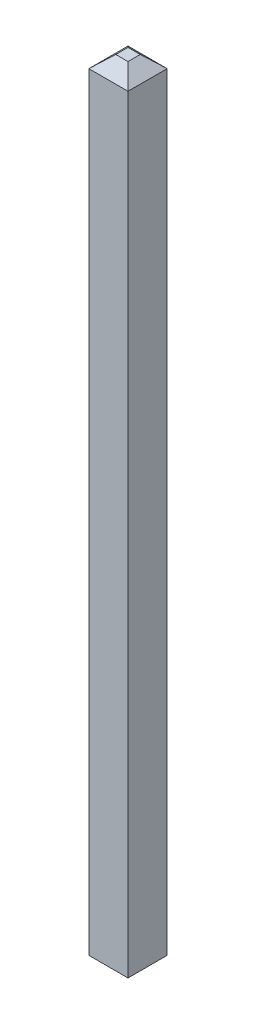
ISO-10303-21;
HEADER;
FILE_DESCRIPTION(('STEP AP214'),'2;1');
FILE_NAME('part.step','',(''),(''),'','','');
FILE_SCHEMA(('AUTOMOTIVE_DESIGN { 1 0 10303 214 1 1 1 1 }'));
ENDSEC;
DATA;
#1=APPLICATION_CONTEXT('core data for automotive mechanical design processes');
#2=APPLICATION_PROTOCOL_DEFINITION('international standard','automotive_design',2000,#1);
#3=PRODUCT_CONTEXT('',#1,'mechanical');
#4=PRODUCT('Part','Part','',(#3));
#5=PRODUCT_RELATED_PRODUCT_CATEGORY('part','',(#4));
#6=PRODUCT_DEFINITION_FORMATION('','',#4);
#7=PRODUCT_DEFINITION_CONTEXT('part definition',#1,'design');
#8=PRODUCT_DEFINITION('design','',#6,#7);
#9=PRODUCT_DEFINITION_SHAPE('','',#8);
#10=(LENGTH_UNIT() NAMED_UNIT(*) SI_UNIT(.MILLI.,.METRE.));
#11=(NAMED_UNIT(*) PLANE_ANGLE_UNIT() SI_UNIT($,.RADIAN.));
#12=(NAMED_UNIT(*) SI_UNIT($,.STERADIAN.) SOLID_ANGLE_UNIT());
#13=UNCERTAINTY_MEASURE_WITH_UNIT(LENGTH_MEASURE(1.E-05),#10,'distance_accuracy_value','');
#14=(GEOMETRIC_REPRESENTATION_CONTEXT(3) GLOBAL_UNCERTAINTY_ASSIGNED_CONTEXT((#13)) GLOBAL_UNIT_ASSIGNED_CONTEXT((#10,
#11,#12)) REPRESENTATION_CONTEXT('',''));
#15=CARTESIAN_POINT('',(0.,0.,0.));
#16=DIRECTION('',(0.,0.,1.));
#17=DIRECTION('',(1.,0.,0.));
#18=AXIS2_PLACEMENT_3D('',#15,#16,#17);
#19=CARTESIAN_POINT('',(0.32,12.54,-0.32));
#20=DIRECTION('',(-1.,0.,0.));
#21=DIRECTION('',(0.,0.,1.));
#22=AXIS2_PLACEMENT_3D('',#19,#20,#21);
#23=PLANE('',#22);
#24=DIRECTION('',(0.,0.,1.));
#25=VECTOR('',#24,1.);
#26=CARTESIAN_POINT('',(0.32,0.,-0.32));
#27=LINE('',#26,#25);
#28=CARTESIAN_POINT('',(0.32,0.,0.32));
#29=VERTEX_POINT('',#28);
#30=CARTESIAN_POINT('',(0.32,0.,-0.32));
#31=VERTEX_POINT('',#30);
#32=EDGE_CURVE('E55',#29,#31,#27,.F.);
#33=ORIENTED_EDGE('',*,*,#32,.T.);
#34=DIRECTION('',(0.,-1.,0.));
#35=VECTOR('',#34,1.);
#36=CARTESIAN_POINT('',(0.32,12.54,-0.32));
#37=LINE('',#36,#35);
#38=CARTESIAN_POINT('',(0.32,12.54,-0.320000000000001));
#39=VERTEX_POINT('',#38);
#40=EDGE_CURVE('E12',#39,#31,#37,.T.);
#41=ORIENTED_EDGE('',*,*,#40,.F.);
#42=DIRECTION('',(0.,0.,1.));
#43=VECTOR('',#42,1.);
#44=CARTESIAN_POINT('',(0.319999999999999,12.54,0.));
#45=LINE('',#44,#43);
#46=CARTESIAN_POINT('',(0.32,12.54,0.32));
#47=VERTEX_POINT('',#46);
#48=EDGE_CURVE('E275',#47,#39,#45,.F.);
#49=ORIENTED_EDGE('',*,*,#48,.F.);
#50=DIRECTION('',(0.,-1.,0.));
#51=VECTOR('',#50,1.);
#52=CARTESIAN_POINT('',(0.32,12.54,0.32));
#53=LINE('',#52,#51);
#54=EDGE_CURVE('E70',#47,#29,#53,.T.);
#55=ORIENTED_EDGE('',*,*,#54,.T.);
#56=EDGE_LOOP('',(#33,#41,#49,#55));
#57=FACE_BOUND('',#56,.T.);
#58=ADVANCED_FACE('F52',(#57),#23,.F.);
#59=CARTESIAN_POINT('',(-0.32,12.54,-0.32));
#60=DIRECTION('',(0.,0.,1.));
#61=DIRECTION('',(1.,0.,0.));
#62=AXIS2_PLACEMENT_3D('',#59,#60,#61);
#63=PLANE('',#62);
#64=DIRECTION('',(1.,0.,0.));
#65=VECTOR('',#64,1.);
#66=CARTESIAN_POINT('',(-0.32,0.,-0.32));
#67=LINE('',#66,#65);
#68=CARTESIAN_POINT('',(-0.32,0.,-0.32));
#69=VERTEX_POINT('',#68);
#70=EDGE_CURVE('E137',#31,#69,#67,.F.);
#71=ORIENTED_EDGE('',*,*,#70,.T.);
#72=DIRECTION('',(0.,-1.,0.));
#73=VECTOR('',#72,1.);
#74=CARTESIAN_POINT('',(-0.32,12.54,-0.32));
#75=LINE('',#74,#73);
#76=CARTESIAN_POINT('',(-0.32,12.54,-0.32));
#77=VERTEX_POINT('',#76);
#78=EDGE_CURVE('E61',#77,#69,#75,.T.);
#79=ORIENTED_EDGE('',*,*,#78,.F.);
#80=DIRECTION('',(1.,0.,0.));
#81=VECTOR('',#80,1.);
#82=CARTESIAN_POINT('',(0.,12.54,-0.320000000000001));
#83=LINE('',#82,#81);
#84=EDGE_CURVE('E142',#39,#77,#83,.F.);
#85=ORIENTED_EDGE('',*,*,#84,.F.);
#86=ORIENTED_EDGE('',*,*,#40,.T.);
#87=EDGE_LOOP('',(#71,#79,#85,#86));
#88=FACE_BOUND('',#87,.T.);
#89=ADVANCED_FACE('F140',(#88),#63,.F.);
#90=CARTESIAN_POINT('',(-0.32,12.54,-0.32));
#91=DIRECTION('',(1.,0.,0.));
#92=DIRECTION('',(0.,0.,-1.));
#93=AXIS2_PLACEMENT_3D('',#90,#91,#92);
#94=PLANE('',#93);
#95=DIRECTION('',(0.,0.,-1.));
#96=VECTOR('',#95,1.);
#97=CARTESIAN_POINT('',(-0.32,0.,-0.32));
#98=LINE('',#97,#96);
#99=CARTESIAN_POINT('',(-0.32,0.,0.32));
#100=VERTEX_POINT('',#99);
#101=EDGE_CURVE('E139',#69,#100,#98,.F.);
#102=ORIENTED_EDGE('',*,*,#101,.T.);
#103=DIRECTION('',(0.,-1.,0.));
#104=VECTOR('',#103,1.);
#105=CARTESIAN_POINT('',(-0.32,12.54,0.32));
#106=LINE('',#105,#104);
#107=CARTESIAN_POINT('',(-0.32,12.54,0.32));
#108=VERTEX_POINT('',#107);
#109=EDGE_CURVE('E283',#108,#100,#106,.T.);
#110=ORIENTED_EDGE('',*,*,#109,.F.);
#111=DIRECTION('',(0.,0.,1.));
#112=VECTOR('',#111,1.);
#113=CARTESIAN_POINT('',(-0.320000000000001,12.54,0.));
#114=LINE('',#113,#112);
#115=EDGE_CURVE('E274',#77,#108,#114,.T.);
#116=ORIENTED_EDGE('',*,*,#115,.F.);
#117=ORIENTED_EDGE('',*,*,#78,.T.);
#118=EDGE_LOOP('',(#102,#110,#116,#117));
#119=FACE_BOUND('',#118,.T.);
#120=ADVANCED_FACE('F289',(#119),#94,.F.);
#121=CARTESIAN_POINT('',(-0.32,12.54,0.32));
#122=DIRECTION('',(0.,0.,-1.));
#123=DIRECTION('',(-1.,0.,0.));
#124=AXIS2_PLACEMENT_3D('',#121,#122,#123);
#125=PLANE('',#124);
#126=DIRECTION('',(-1.,0.,0.));
#127=VECTOR('',#126,1.);
#128=CARTESIAN_POINT('',(-0.32,0.,0.32));
#129=LINE('',#128,#127);
#130=EDGE_CURVE('E277',#100,#29,#129,.F.);
#131=ORIENTED_EDGE('',*,*,#130,.T.);
#132=ORIENTED_EDGE('',*,*,#54,.F.);
#133=DIRECTION('',(1.,0.,0.));
#134=VECTOR('',#133,1.);
#135=CARTESIAN_POINT('',(0.,12.54,0.319999999999999));
#136=LINE('',#135,#134);
#137=EDGE_CURVE('E276',#108,#47,#136,.T.);
#138=ORIENTED_EDGE('',*,*,#137,.F.);
#139=ORIENTED_EDGE('',*,*,#109,.T.);
#140=EDGE_LOOP('',(#131,#132,#138,#139));
#141=FACE_BOUND('',#140,.T.);
#142=ADVANCED_FACE('F200',(#141),#125,.F.);
#143=CARTESIAN_POINT('',(0.,12.74,0.));
#144=DIRECTION('',(0.,-1.,0.));
#145=DIRECTION('',(0.,0.,-1.));
#146=AXIS2_PLACEMENT_3D('',#143,#144,#145);
#147=PLANE('',#146);
#148=DIRECTION('',(0.,0.,1.));
#149=VECTOR('',#148,1.);
#150=CARTESIAN_POINT('',(-0.1,12.74,-0.1));
#151=LINE('',#150,#149);
#152=CARTESIAN_POINT('',(-0.1,12.74,-0.1));
#153=VERTEX_POINT('',#152);
#154=CARTESIAN_POINT('',(-0.1,12.74,0.1));
#155=VERTEX_POINT('',#154);
#156=EDGE_CURVE('E181',#153,#155,#151,.T.);
#157=ORIENTED_EDGE('',*,*,#156,.T.);
#158=DIRECTION('',(1.,0.,0.));
#159=VECTOR('',#158,1.);
#160=CARTESIAN_POINT('',(0.1,12.74,0.1));
#161=LINE('',#160,#159);
#162=CARTESIAN_POINT('',(0.1,12.74,0.1));
#163=VERTEX_POINT('',#162);
#164=EDGE_CURVE('E154',#155,#163,#161,.T.);
#165=ORIENTED_EDGE('',*,*,#164,.T.);
#166=DIRECTION('',(0.,0.,-1.));
#167=VECTOR('',#166,1.);
#168=CARTESIAN_POINT('',(0.1,12.74,-0.1));
#169=LINE('',#168,#167);
#170=CARTESIAN_POINT('',(0.1,12.74,-0.1));
#171=VERTEX_POINT('',#170);
#172=EDGE_CURVE('E146',#163,#171,#169,.T.);
#173=ORIENTED_EDGE('',*,*,#172,.T.);
#174=DIRECTION('',(-1.,0.,0.));
#175=VECTOR('',#174,1.);
#176=CARTESIAN_POINT('',(0.1,12.74,-0.1));
#177=LINE('',#176,#175);
#178=EDGE_CURVE('E145',#171,#153,#177,.T.);
#179=ORIENTED_EDGE('',*,*,#178,.T.);
#180=EDGE_LOOP('',(#157,#165,#173,#179));
#181=FACE_BOUND('',#180,.T.);
#182=ADVANCED_FACE('F189',(#181),#147,.F.);
#183=CARTESIAN_POINT('',(0.,7.02506787330315,-6.38642533936652));
#184=DIRECTION('',(0.,0.739940073395943,-0.672672793996314));
#185=DIRECTION('',(0.,0.672672793996314,0.739940073395943));
#186=AXIS2_PLACEMENT_3D('',#183,#184,#185);
#187=PLANE('',#186);
#188=DIRECTION('',(0.594811877479462,-0.540738070435876,-0.594811877479462));
#189=VECTOR('',#188,1.);
#190=CARTESIAN_POINT('',(0.1,12.74,-0.1));
#191=LINE('',#190,#189);
#192=EDGE_CURVE('E216',#171,#39,#191,.T.);
#193=ORIENTED_EDGE('',*,*,#192,.T.);
#194=ORIENTED_EDGE('',*,*,#84,.T.);
#195=DIRECTION('',(-0.594811877479462,-0.540738070435876,-0.594811877479462));
#196=VECTOR('',#195,1.);
#197=CARTESIAN_POINT('',(-0.1,12.74,-0.1));
#198=LINE('',#197,#196);
#199=EDGE_CURVE('E214',#153,#77,#198,.T.);
#200=ORIENTED_EDGE('',*,*,#199,.F.);
#201=ORIENTED_EDGE('',*,*,#178,.F.);
#202=EDGE_LOOP('',(#193,#194,#200,#201));
#203=FACE_BOUND('',#202,.T.);
#204=ADVANCED_FACE('F199',(#203),#187,.T.);
#205=CARTESIAN_POINT('',(-6.38642533936652,7.02506787330315,0.));
#206=DIRECTION('',(-0.672672793996314,0.739940073395943,0.));
#207=DIRECTION('',(-0.739940073395943,-0.672672793996314,0.));
#208=AXIS2_PLACEMENT_3D('',#205,#206,#207);
#209=PLANE('',#208);
#210=ORIENTED_EDGE('',*,*,#199,.T.);
#211=ORIENTED_EDGE('',*,*,#115,.T.);
#212=DIRECTION('',(-0.594811877479462,-0.540738070435876,0.594811877479462));
#213=VECTOR('',#212,1.);
#214=CARTESIAN_POINT('',(-0.1,12.74,0.1));
#215=LINE('',#214,#213);
#216=EDGE_CURVE('E261',#155,#108,#215,.T.);
#217=ORIENTED_EDGE('',*,*,#216,.F.);
#218=ORIENTED_EDGE('',*,*,#156,.F.);
#219=EDGE_LOOP('',(#210,#211,#217,#218));
#220=FACE_BOUND('',#219,.T.);
#221=ADVANCED_FACE('F248',(#220),#209,.T.);
#222=CARTESIAN_POINT('',(6.38642533936652,7.02506787330315,0.));
#223=DIRECTION('',(0.672672793996313,0.739940073395943,0.));
#224=DIRECTION('',(-0.739940073395943,0.672672793996313,0.));
#225=AXIS2_PLACEMENT_3D('',#222,#223,#224);
#226=PLANE('',#225);
#227=DIRECTION('',(0.594811877479462,-0.540738070435876,0.594811877479462));
#228=VECTOR('',#227,1.);
#229=CARTESIAN_POINT('',(0.1,12.74,0.1));
#230=LINE('',#229,#228);
#231=EDGE_CURVE('E222',#163,#47,#230,.T.);
#232=ORIENTED_EDGE('',*,*,#231,.T.);
#233=ORIENTED_EDGE('',*,*,#48,.T.);
#234=ORIENTED_EDGE('',*,*,#192,.F.);
#235=ORIENTED_EDGE('',*,*,#172,.F.);
#236=EDGE_LOOP('',(#232,#233,#234,#235));
#237=FACE_BOUND('',#236,.T.);
#238=ADVANCED_FACE('F238',(#237),#226,.T.);
#239=CARTESIAN_POINT('',(0.,7.02506787330315,6.38642533936652));
#240=DIRECTION('',(0.,0.739940073395943,0.672672793996313));
#241=DIRECTION('',(0.,-0.672672793996313,0.739940073395943));
#242=AXIS2_PLACEMENT_3D('',#239,#240,#241);
#243=PLANE('',#242);
#244=ORIENTED_EDGE('',*,*,#216,.T.);
#245=ORIENTED_EDGE('',*,*,#137,.T.);
#246=ORIENTED_EDGE('',*,*,#231,.F.);
#247=ORIENTED_EDGE('',*,*,#164,.F.);
#248=EDGE_LOOP('',(#244,#245,#246,#247));
#249=FACE_BOUND('',#248,.T.);
#250=ADVANCED_FACE('F247',(#249),#243,.T.);
#251=CARTESIAN_POINT('',(0.,-0.2,0.));
#252=DIRECTION('',(0.,1.,0.));
#253=DIRECTION('',(0.,0.,1.));
#254=AXIS2_PLACEMENT_3D('',#251,#252,#253);
#255=PLANE('',#254);
#256=DIRECTION('',(0.,0.,1.));
#257=VECTOR('',#256,1.);
#258=CARTESIAN_POINT('',(0.1,-0.2,-0.1));
#259=LINE('',#258,#257);
#260=CARTESIAN_POINT('',(0.1,-0.2,-0.1));
#261=VERTEX_POINT('',#260);
#262=CARTESIAN_POINT('',(0.1,-0.2,0.1));
#263=VERTEX_POINT('',#262);
#264=EDGE_CURVE('E132',#261,#263,#259,.T.);
#265=ORIENTED_EDGE('',*,*,#264,.T.);
#266=DIRECTION('',(-1.,0.,0.));
#267=VECTOR('',#266,1.);
#268=CARTESIAN_POINT('',(-0.1,-0.2,0.1));
#269=LINE('',#268,#267);
#270=CARTESIAN_POINT('',(-0.1,-0.2,0.1));
#271=VERTEX_POINT('',#270);
#272=EDGE_CURVE('E302',#263,#271,#269,.T.);
#273=ORIENTED_EDGE('',*,*,#272,.T.);
#274=DIRECTION('',(0.,0.,-1.));
#275=VECTOR('',#274,1.);
#276=CARTESIAN_POINT('',(-0.1,-0.2,-0.1));
#277=LINE('',#276,#275);
#278=CARTESIAN_POINT('',(-0.1,-0.2,-0.1));
#279=VERTEX_POINT('',#278);
#280=EDGE_CURVE('E299',#271,#279,#277,.T.);
#281=ORIENTED_EDGE('',*,*,#280,.T.);
#282=DIRECTION('',(1.,0.,0.));
#283=VECTOR('',#282,1.);
#284=CARTESIAN_POINT('',(-0.1,-0.2,-0.1));
#285=LINE('',#284,#283);
#286=EDGE_CURVE('E269',#279,#261,#285,.T.);
#287=ORIENTED_EDGE('',*,*,#286,.T.);
#288=EDGE_LOOP('',(#265,#273,#281,#287));
#289=FACE_BOUND('',#288,.T.);
#290=ADVANCED_FACE('F253',(#289),#255,.F.);
#291=CARTESIAN_POINT('',(0.,-0.159276018099548,0.144796380090498));
#292=DIRECTION('',(0.,-0.739940073395944,0.672672793996312));
#293=DIRECTION('',(0.,-0.672672793996312,-0.739940073395944));
#294=AXIS2_PLACEMENT_3D('',#291,#292,#293);
#295=PLANE('',#294);
#296=DIRECTION('',(0.594811877479463,0.540738070435875,0.594811877479463));
#297=VECTOR('',#296,1.);
#298=CARTESIAN_POINT('',(0.1,-0.2,0.1));
#299=LINE('',#298,#297);
#300=EDGE_CURVE('E135',#263,#29,#299,.T.);
#301=ORIENTED_EDGE('',*,*,#300,.T.);
#302=ORIENTED_EDGE('',*,*,#130,.F.);
#303=DIRECTION('',(-0.594811877479462,0.540738070435875,0.594811877479463));
#304=VECTOR('',#303,1.);
#305=CARTESIAN_POINT('',(-0.1,-0.2,0.1));
#306=LINE('',#305,#304);
#307=EDGE_CURVE('E295',#271,#100,#306,.T.);
#308=ORIENTED_EDGE('',*,*,#307,.F.);
#309=ORIENTED_EDGE('',*,*,#272,.F.);
#310=EDGE_LOOP('',(#301,#302,#308,#309));
#311=FACE_BOUND('',#310,.T.);
#312=ADVANCED_FACE('F294',(#311),#295,.T.);
#313=CARTESIAN_POINT('',(-0.144796380090498,-0.159276018099547,0.));
#314=DIRECTION('',(-0.672672793996313,-0.739940073395944,0.));
#315=DIRECTION('',(0.739940073395944,-0.672672793996313,0.));
#316=AXIS2_PLACEMENT_3D('',#313,#314,#315);
#317=PLANE('',#316);
#318=ORIENTED_EDGE('',*,*,#307,.T.);
#319=ORIENTED_EDGE('',*,*,#101,.F.);
#320=DIRECTION('',(-0.594811877479463,0.540738070435875,-0.594811877479463));
#321=VECTOR('',#320,1.);
#322=CARTESIAN_POINT('',(-0.1,-0.2,-0.1));
#323=LINE('',#322,#321);
#324=EDGE_CURVE('E103',#279,#69,#323,.T.);
#325=ORIENTED_EDGE('',*,*,#324,.F.);
#326=ORIENTED_EDGE('',*,*,#280,.F.);
#327=EDGE_LOOP('',(#318,#319,#325,#326));
#328=FACE_BOUND('',#327,.T.);
#329=ADVANCED_FACE('F297',(#328),#317,.T.);
#330=CARTESIAN_POINT('',(0.144796380090498,-0.159276018099548,0.));
#331=DIRECTION('',(0.672672793996312,-0.739940073395944,0.));
#332=DIRECTION('',(0.739940073395944,0.672672793996313,0.));
#333=AXIS2_PLACEMENT_3D('',#330,#331,#332);
#334=PLANE('',#333);
#335=DIRECTION('',(0.594811877479463,0.540738070435875,-0.594811877479463));
#336=VECTOR('',#335,1.);
#337=CARTESIAN_POINT('',(0.1,-0.2,-0.1));
#338=LINE('',#337,#336);
#339=EDGE_CURVE('E128',#261,#31,#338,.T.);
#340=ORIENTED_EDGE('',*,*,#339,.T.);
#341=ORIENTED_EDGE('',*,*,#32,.F.);
#342=ORIENTED_EDGE('',*,*,#300,.F.);
#343=ORIENTED_EDGE('',*,*,#264,.F.);
#344=EDGE_LOOP('',(#340,#341,#342,#343));
#345=FACE_BOUND('',#344,.T.);
#346=ADVANCED_FACE('F130',(#345),#334,.T.);
#347=CARTESIAN_POINT('',(0.,-0.159276018099548,-0.144796380090498));
#348=DIRECTION('',(0.,-0.739940073395944,-0.672672793996313));
#349=DIRECTION('',(0.,0.672672793996313,-0.739940073395944));
#350=AXIS2_PLACEMENT_3D('',#347,#348,#349);
#351=PLANE('',#350);
#352=ORIENTED_EDGE('',*,*,#324,.T.);
#353=ORIENTED_EDGE('',*,*,#70,.F.);
#354=ORIENTED_EDGE('',*,*,#339,.F.);
#355=ORIENTED_EDGE('',*,*,#286,.F.);
#356=EDGE_LOOP('',(#352,#353,#354,#355));
#357=FACE_BOUND('',#356,.T.);
#358=ADVANCED_FACE('F138',(#357),#351,.T.);
#359=CLOSED_SHELL('',(#58,#89,#120,#142,#182,#204,#221,#238,#250,#290,#312,#329,#346,#358));
#360=MANIFOLD_SOLID_BREP('B2',#359);
#361=ADVANCED_BREP_SHAPE_REPRESENTATION('',(#18,#360),#14);
#362=SHAPE_DEFINITION_REPRESENTATION(#9,#361);
ENDSEC;
END-ISO-10303-21;
